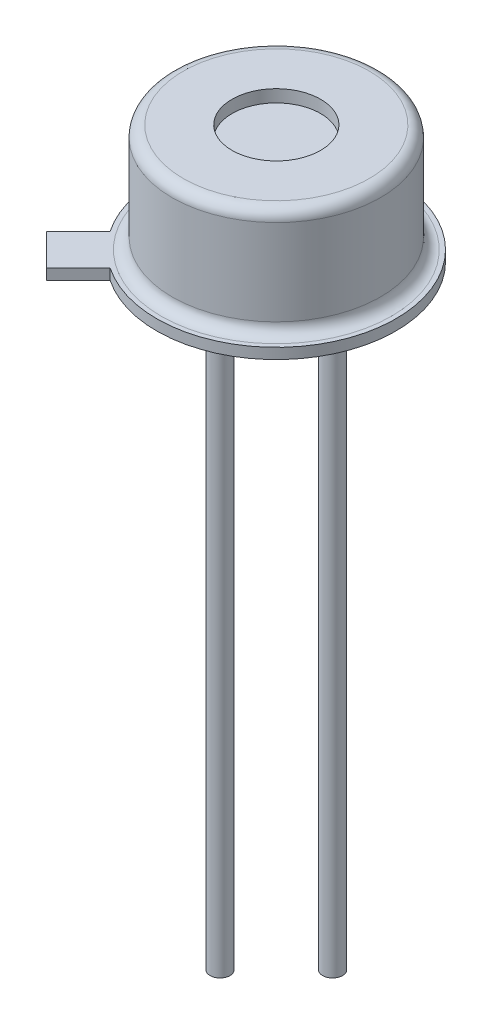
ISO-10303-21;
HEADER;
FILE_DESCRIPTION(('STEP AP214'),'2;1');
FILE_NAME('part.step','',(''),(''),'','','');
FILE_SCHEMA(('AUTOMOTIVE_DESIGN { 1 0 10303 214 1 1 1 1 }'));
ENDSEC;
DATA;
#1=APPLICATION_CONTEXT('core data for automotive mechanical design processes');
#2=APPLICATION_PROTOCOL_DEFINITION('international standard','automotive_design',2000,#1);
#3=PRODUCT_CONTEXT('',#1,'mechanical');
#4=PRODUCT('Part','Part','',(#3));
#5=PRODUCT_RELATED_PRODUCT_CATEGORY('part','',(#4));
#6=PRODUCT_DEFINITION_FORMATION('','',#4);
#7=PRODUCT_DEFINITION_CONTEXT('part definition',#1,'design');
#8=PRODUCT_DEFINITION('design','',#6,#7);
#9=PRODUCT_DEFINITION_SHAPE('','',#8);
#10=(LENGTH_UNIT() NAMED_UNIT(*) SI_UNIT(.MILLI.,.METRE.));
#11=(NAMED_UNIT(*) PLANE_ANGLE_UNIT() SI_UNIT($,.RADIAN.));
#12=(NAMED_UNIT(*) SI_UNIT($,.STERADIAN.) SOLID_ANGLE_UNIT());
#13=UNCERTAINTY_MEASURE_WITH_UNIT(LENGTH_MEASURE(1.E-05),#10,'distance_accuracy_value','');
#14=(GEOMETRIC_REPRESENTATION_CONTEXT(3) GLOBAL_UNCERTAINTY_ASSIGNED_CONTEXT((#13)) GLOBAL_UNIT_ASSIGNED_CONTEXT((#10,
#11,#12)) REPRESENTATION_CONTEXT('',''));
#15=CARTESIAN_POINT('',(0.,0.,0.));
#16=DIRECTION('',(0.,0.,1.));
#17=DIRECTION('',(1.,0.,0.));
#18=AXIS2_PLACEMENT_3D('',#15,#16,#17);
#19=CARTESIAN_POINT('',(0.,0.,0.));
#20=DIRECTION('',(0.,1.,0.));
#21=DIRECTION('',(0.,0.,1.));
#22=AXIS2_PLACEMENT_3D('',#19,#20,#21);
#23=PLANE('',#22);
#24=CARTESIAN_POINT('',(0.,0.,-1.27));
#25=DIRECTION('',(0.,1.,0.));
#26=DIRECTION('',(0.,0.,1.));
#27=AXIS2_PLACEMENT_3D('',#24,#25,#26);
#28=CIRCLE('',#27,0.6);
#29=CARTESIAN_POINT('',(0.,0.,-0.67));
#30=VERTEX_POINT('',#29);
#31=EDGE_CURVE('E47',#30,#30,#28,.F.);
#32=ORIENTED_EDGE('',*,*,#31,.F.);
#33=EDGE_LOOP('',(#32));
#34=FACE_BOUND('',#33,.T.);
#35=CARTESIAN_POINT('',(0.,0.,0.));
#36=DIRECTION('',(0.,1.,0.));
#37=DIRECTION('',(0.,0.,1.));
#38=AXIS2_PLACEMENT_3D('',#35,#36,#37);
#39=CIRCLE('',#38,2.7);
#40=CARTESIAN_POINT('',(-1.51588121959302,0.,2.23430170927858));
#41=VERTEX_POINT('',#40);
#42=CARTESIAN_POINT('',(-2.23430170927856,0.,1.51588121959305));
#43=VERTEX_POINT('',#42);
#44=EDGE_CURVE('E106',#41,#43,#39,.T.);
#45=ORIENTED_EDGE('',*,*,#44,.F.);
#46=DIRECTION('',(0.707106781186544,0.,-0.707106781186551));
#47=VECTOR('',#46,1.);
#48=CARTESIAN_POINT('',(-2.23430170927855,0.,2.95272219896411));
#49=LINE('',#48,#47);
#50=CARTESIAN_POINT('',(-2.23430170927855,0.,2.95272219896411));
#51=VERTEX_POINT('',#50);
#52=EDGE_CURVE('E78',#51,#41,#49,.T.);
#53=ORIENTED_EDGE('',*,*,#52,.F.);
#54=DIRECTION('',(0.707106781186551,0.,0.707106781186544));
#55=VECTOR('',#54,1.);
#56=CARTESIAN_POINT('',(-2.95272219896409,0.,2.23430170927858));
#57=LINE('',#56,#55);
#58=CARTESIAN_POINT('',(-2.95272219896409,0.,2.23430170927858));
#59=VERTEX_POINT('',#58);
#60=EDGE_CURVE('E72',#59,#51,#57,.T.);
#61=ORIENTED_EDGE('',*,*,#60,.F.);
#62=DIRECTION('',(-0.707106781186544,0.,0.707106781186551));
#63=VECTOR('',#62,1.);
#64=CARTESIAN_POINT('',(-2.23430170927856,0.,1.51588121959305));
#65=LINE('',#64,#63);
#66=EDGE_CURVE('E96',#43,#59,#65,.T.);
#67=ORIENTED_EDGE('',*,*,#66,.F.);
#68=EDGE_LOOP('',(#45,#53,#61,#67));
#69=FACE_BOUND('',#68,.T.);
#70=CARTESIAN_POINT('',(1.27,0.,0.));
#71=DIRECTION('',(0.,1.,0.));
#72=DIRECTION('',(0.,0.,1.));
#73=AXIS2_PLACEMENT_3D('',#70,#71,#72);
#74=CIRCLE('',#73,0.225);
#75=CARTESIAN_POINT('',(1.27,0.,0.225));
#76=VERTEX_POINT('',#75);
#77=EDGE_CURVE('E122',#76,#76,#74,.F.);
#78=ORIENTED_EDGE('',*,*,#77,.F.);
#79=EDGE_LOOP('',(#78));
#80=FACE_BOUND('',#79,.T.);
#81=CARTESIAN_POINT('',(0.,0.,1.27));
#82=DIRECTION('',(0.,1.,0.));
#83=DIRECTION('',(0.,0.,1.));
#84=AXIS2_PLACEMENT_3D('',#81,#82,#83);
#85=CIRCLE('',#84,0.6);
#86=CARTESIAN_POINT('',(0.,0.,1.87));
#87=VERTEX_POINT('',#86);
#88=EDGE_CURVE('E11',#87,#87,#85,.F.);
#89=ORIENTED_EDGE('',*,*,#88,.F.);
#90=EDGE_LOOP('',(#89));
#91=FACE_BOUND('',#90,.T.);
#92=ADVANCED_FACE('F37',(#34,#69,#80,#91),#23,.F.);
#93=ORIENTED_EDGE('',*,*,#88,.T.);
#94=EDGE_LOOP('',(#93));
#95=FACE_BOUND('',#94,.T.);
#96=CARTESIAN_POINT('',(0.,0.,1.27));
#97=DIRECTION('',(0.,1.,0.));
#98=DIRECTION('',(0.,0.,1.));
#99=AXIS2_PLACEMENT_3D('',#96,#97,#98);
#100=CIRCLE('',#99,0.225);
#101=CARTESIAN_POINT('',(0.,0.,1.495));
#102=VERTEX_POINT('',#101);
#103=EDGE_CURVE('E116',#102,#102,#100,.F.);
#104=ORIENTED_EDGE('',*,*,#103,.F.);
#105=EDGE_LOOP('',(#104));
#106=FACE_BOUND('',#105,.T.);
#107=ADVANCED_FACE('F147',(#95,#106),#23,.F.);
#108=ORIENTED_EDGE('',*,*,#31,.T.);
#109=EDGE_LOOP('',(#108));
#110=FACE_BOUND('',#109,.T.);
#111=CARTESIAN_POINT('',(0.,0.,-1.27));
#112=DIRECTION('',(0.,1.,0.));
#113=DIRECTION('',(0.,0.,1.));
#114=AXIS2_PLACEMENT_3D('',#111,#112,#113);
#115=CIRCLE('',#114,0.225);
#116=CARTESIAN_POINT('',(0.,0.,-1.045));
#117=VERTEX_POINT('',#116);
#118=EDGE_CURVE('E119',#117,#117,#115,.F.);
#119=ORIENTED_EDGE('',*,*,#118,.F.);
#120=EDGE_LOOP('',(#119));
#121=FACE_BOUND('',#120,.T.);
#122=ADVANCED_FACE('F142',(#110,#121),#23,.F.);
#123=CARTESIAN_POINT('',(0.,0.24,0.));
#124=DIRECTION('',(0.,1.,0.));
#125=DIRECTION('',(0.,0.,1.));
#126=AXIS2_PLACEMENT_3D('',#123,#124,#125);
#127=PLANE('',#126);
#128=CARTESIAN_POINT('',(0.,0.24,0.));
#129=DIRECTION('',(0.,1.,0.));
#130=DIRECTION('',(0.,0.,1.));
#131=AXIS2_PLACEMENT_3D('',#128,#129,#130);
#132=CIRCLE('',#131,2.6);
#133=CARTESIAN_POINT('',(0.,0.24,2.6));
#134=VERTEX_POINT('',#133);
#135=EDGE_CURVE('E134',#134,#134,#132,.F.);
#136=ORIENTED_EDGE('',*,*,#135,.T.);
#137=EDGE_LOOP('',(#136));
#138=FACE_BOUND('',#137,.T.);
#139=CARTESIAN_POINT('',(0.,0.24,0.));
#140=DIRECTION('',(0.,1.,0.));
#141=DIRECTION('',(0.,0.,1.));
#142=AXIS2_PLACEMENT_3D('',#139,#140,#141);
#143=CIRCLE('',#142,2.7);
#144=CARTESIAN_POINT('',(-1.51588121959302,0.24,2.23430170927858));
#145=VERTEX_POINT('',#144);
#146=CARTESIAN_POINT('',(-2.23430170927856,0.24,1.51588121959305));
#147=VERTEX_POINT('',#146);
#148=EDGE_CURVE('E91',#145,#147,#143,.T.);
#149=ORIENTED_EDGE('',*,*,#148,.T.);
#150=DIRECTION('',(-0.707106781186544,0.,0.707106781186551));
#151=VECTOR('',#150,1.);
#152=CARTESIAN_POINT('',(-2.23430170927856,0.24,1.51588121959305));
#153=LINE('',#152,#151);
#154=CARTESIAN_POINT('',(-2.95272219896409,0.24,2.23430170927858));
#155=VERTEX_POINT('',#154);
#156=EDGE_CURVE('E86',#147,#155,#153,.T.);
#157=ORIENTED_EDGE('',*,*,#156,.T.);
#158=DIRECTION('',(0.707106781186551,0.,0.707106781186544));
#159=VECTOR('',#158,1.);
#160=CARTESIAN_POINT('',(-2.95272219896409,0.24,2.23430170927858));
#161=LINE('',#160,#159);
#162=CARTESIAN_POINT('',(-2.23430170927855,0.24,2.95272219896411));
#163=VERTEX_POINT('',#162);
#164=EDGE_CURVE('E89',#155,#163,#161,.T.);
#165=ORIENTED_EDGE('',*,*,#164,.T.);
#166=DIRECTION('',(0.707106781186544,0.,-0.707106781186551));
#167=VECTOR('',#166,1.);
#168=CARTESIAN_POINT('',(-2.23430170927855,0.24,2.95272219896411));
#169=LINE('',#168,#167);
#170=EDGE_CURVE('E55',#163,#145,#169,.T.);
#171=ORIENTED_EDGE('',*,*,#170,.T.);
#172=EDGE_LOOP('',(#149,#157,#165,#171));
#173=FACE_BOUND('',#172,.T.);
#174=ADVANCED_FACE('F87',(#138,#173),#127,.T.);
#175=CARTESIAN_POINT('',(0.,0.24,0.));
#176=DIRECTION('',(0.,-1.,0.));
#177=DIRECTION('',(0.,0.,-1.));
#178=AXIS2_PLACEMENT_3D('',#175,#176,#177);
#179=CYLINDRICAL_SURFACE('',#178,2.7);
#180=ORIENTED_EDGE('',*,*,#44,.T.);
#181=DIRECTION('',(0.,-1.,0.));
#182=VECTOR('',#181,1.);
#183=CARTESIAN_POINT('',(-2.23430170927856,0.24,1.51588121959305));
#184=LINE('',#183,#182);
#185=EDGE_CURVE('E97',#147,#43,#184,.T.);
#186=ORIENTED_EDGE('',*,*,#185,.F.);
#187=ORIENTED_EDGE('',*,*,#148,.F.);
#188=DIRECTION('',(0.,-1.,0.));
#189=VECTOR('',#188,1.);
#190=CARTESIAN_POINT('',(-1.51588121959302,0.24,2.23430170927858));
#191=LINE('',#190,#189);
#192=EDGE_CURVE('E102',#145,#41,#191,.T.);
#193=ORIENTED_EDGE('',*,*,#192,.T.);
#194=EDGE_LOOP('',(#180,#186,#187,#193));
#195=FACE_BOUND('',#194,.T.);
#196=ADVANCED_FACE('F191',(#195),#179,.T.);
#197=CARTESIAN_POINT('',(-2.23430170927856,0.24,1.51588121959305));
#198=DIRECTION('',(0.707106781186551,0.,0.707106781186544));
#199=DIRECTION('',(0.707106781186544,0.,-0.707106781186551));
#200=AXIS2_PLACEMENT_3D('',#197,#198,#199);
#201=PLANE('',#200);
#202=ORIENTED_EDGE('',*,*,#66,.T.);
#203=DIRECTION('',(0.,-1.,0.));
#204=VECTOR('',#203,1.);
#205=CARTESIAN_POINT('',(-2.95272219896409,0.24,2.23430170927858));
#206=LINE('',#205,#204);
#207=EDGE_CURVE('E94',#155,#59,#206,.T.);
#208=ORIENTED_EDGE('',*,*,#207,.F.);
#209=ORIENTED_EDGE('',*,*,#156,.F.);
#210=ORIENTED_EDGE('',*,*,#185,.T.);
#211=EDGE_LOOP('',(#202,#208,#209,#210));
#212=FACE_BOUND('',#211,.T.);
#213=ADVANCED_FACE('F95',(#212),#201,.F.);
#214=CARTESIAN_POINT('',(-2.95272219896409,0.24,2.23430170927858));
#215=DIRECTION('',(0.707106781186544,0.,-0.707106781186551));
#216=DIRECTION('',(-0.707106781186551,0.,-0.707106781186544));
#217=AXIS2_PLACEMENT_3D('',#214,#215,#216);
#218=PLANE('',#217);
#219=ORIENTED_EDGE('',*,*,#60,.T.);
#220=DIRECTION('',(0.,-1.,0.));
#221=VECTOR('',#220,1.);
#222=CARTESIAN_POINT('',(-2.23430170927855,0.24,2.95272219896411));
#223=LINE('',#222,#221);
#224=EDGE_CURVE('E98',#163,#51,#223,.T.);
#225=ORIENTED_EDGE('',*,*,#224,.F.);
#226=ORIENTED_EDGE('',*,*,#164,.F.);
#227=ORIENTED_EDGE('',*,*,#207,.T.);
#228=EDGE_LOOP('',(#219,#225,#226,#227));
#229=FACE_BOUND('',#228,.T.);
#230=ADVANCED_FACE('F100',(#229),#218,.F.);
#231=CARTESIAN_POINT('',(-2.23430170927855,0.24,2.95272219896411));
#232=DIRECTION('',(-0.707106781186551,0.,-0.707106781186544));
#233=DIRECTION('',(-0.707106781186544,0.,0.707106781186551));
#234=AXIS2_PLACEMENT_3D('',#231,#232,#233);
#235=PLANE('',#234);
#236=ORIENTED_EDGE('',*,*,#52,.T.);
#237=ORIENTED_EDGE('',*,*,#192,.F.);
#238=ORIENTED_EDGE('',*,*,#170,.F.);
#239=ORIENTED_EDGE('',*,*,#224,.T.);
#240=EDGE_LOOP('',(#236,#237,#238,#239));
#241=FACE_BOUND('',#240,.T.);
#242=ADVANCED_FACE('F188',(#241),#235,.F.);
#243=CARTESIAN_POINT('',(0.,2.68,0.));
#244=DIRECTION('',(0.,-1.,0.));
#245=DIRECTION('',(0.,0.,-1.));
#246=AXIS2_PLACEMENT_3D('',#243,#244,#245);
#247=CYLINDRICAL_SURFACE('',#246,2.35);
#248=CARTESIAN_POINT('',(0.,2.43,0.));
#249=DIRECTION('',(0.,1.,0.));
#250=DIRECTION('',(0.,0.,1.));
#251=AXIS2_PLACEMENT_3D('',#248,#249,#250);
#252=CIRCLE('',#251,2.35);
#253=CARTESIAN_POINT('',(0.,2.43,2.35));
#254=VERTEX_POINT('',#253);
#255=EDGE_CURVE('E131',#254,#254,#252,.F.);
#256=ORIENTED_EDGE('',*,*,#255,.T.);
#257=EDGE_LOOP('',(#256));
#258=FACE_BOUND('',#257,.T.);
#259=CARTESIAN_POINT('',(0.,0.49,0.));
#260=DIRECTION('',(0.,1.,0.));
#261=DIRECTION('',(0.,0.,1.));
#262=AXIS2_PLACEMENT_3D('',#259,#260,#261);
#263=CIRCLE('',#262,2.35);
#264=CARTESIAN_POINT('',(0.,0.49,2.35));
#265=VERTEX_POINT('',#264);
#266=EDGE_CURVE('E128',#265,#265,#263,.T.);
#267=ORIENTED_EDGE('',*,*,#266,.T.);
#268=EDGE_LOOP('',(#267));
#269=FACE_BOUND('',#268,.T.);
#270=ADVANCED_FACE('F184',(#258,#269),#247,.T.);
#271=CARTESIAN_POINT('',(0.,2.68,0.));
#272=DIRECTION('',(0.,1.,0.));
#273=DIRECTION('',(0.,0.,1.));
#274=AXIS2_PLACEMENT_3D('',#271,#272,#273);
#275=PLANE('',#274);
#276=CARTESIAN_POINT('',(0.,2.68,0.));
#277=DIRECTION('',(0.,1.,0.));
#278=DIRECTION('',(0.,0.,1.));
#279=AXIS2_PLACEMENT_3D('',#276,#277,#278);
#280=CIRCLE('',#279,2.1);
#281=CARTESIAN_POINT('',(0.,2.68,2.1));
#282=VERTEX_POINT('',#281);
#283=EDGE_CURVE('E125',#282,#282,#280,.T.);
#284=ORIENTED_EDGE('',*,*,#283,.T.);
#285=EDGE_LOOP('',(#284));
#286=FACE_BOUND('',#285,.T.);
#287=CARTESIAN_POINT('',(0.,2.68,0.));
#288=DIRECTION('',(0.,1.,0.));
#289=DIRECTION('',(0.,0.,1.));
#290=AXIS2_PLACEMENT_3D('',#287,#288,#289);
#291=CIRCLE('',#290,1.);
#292=CARTESIAN_POINT('',(0.,2.68,1.));
#293=VERTEX_POINT('',#292);
#294=EDGE_CURVE('E221',#293,#293,#291,.T.);
#295=ORIENTED_EDGE('',*,*,#294,.F.);
#296=EDGE_LOOP('',(#295));
#297=FACE_BOUND('',#296,.T.);
#298=ADVANCED_FACE('F180',(#286,#297),#275,.T.);
#299=CARTESIAN_POINT('',(0.,2.4006,0.));
#300=DIRECTION('',(0.,1.,0.));
#301=DIRECTION('',(0.,0.,1.));
#302=AXIS2_PLACEMENT_3D('',#299,#300,#301);
#303=CYLINDRICAL_SURFACE('',#302,1.);
#304=CARTESIAN_POINT('',(0.,2.4006,0.));
#305=DIRECTION('',(0.,1.,0.));
#306=DIRECTION('',(0.,0.,1.));
#307=AXIS2_PLACEMENT_3D('',#304,#305,#306);
#308=CIRCLE('',#307,1.);
#309=CARTESIAN_POINT('',(0.,2.4006,1.));
#310=VERTEX_POINT('',#309);
#311=EDGE_CURVE('E109',#310,#310,#308,.T.);
#312=ORIENTED_EDGE('',*,*,#311,.F.);
#313=EDGE_LOOP('',(#312));
#314=FACE_BOUND('',#313,.T.);
#315=ORIENTED_EDGE('',*,*,#294,.T.);
#316=EDGE_LOOP('',(#315));
#317=FACE_BOUND('',#316,.T.);
#318=ADVANCED_FACE('F172',(#314,#317),#303,.F.);
#319=CARTESIAN_POINT('',(0.,2.4006,0.));
#320=DIRECTION('',(0.,1.,0.));
#321=DIRECTION('',(0.,0.,1.));
#322=AXIS2_PLACEMENT_3D('',#319,#320,#321);
#323=PLANE('',#322);
#324=ORIENTED_EDGE('',*,*,#311,.T.);
#325=EDGE_LOOP('',(#324));
#326=FACE_BOUND('',#325,.T.);
#327=ADVANCED_FACE('F162',(#326),#323,.T.);
#328=CARTESIAN_POINT('',(0.,-13.2,1.27));
#329=DIRECTION('',(0.,1.,0.));
#330=DIRECTION('',(0.,0.,1.));
#331=AXIS2_PLACEMENT_3D('',#328,#329,#330);
#332=CYLINDRICAL_SURFACE('',#331,0.225);
#333=CARTESIAN_POINT('',(0.,-13.2,1.27));
#334=DIRECTION('',(0.,-1.,0.));
#335=DIRECTION('',(0.,0.,-1.));
#336=AXIS2_PLACEMENT_3D('',#333,#334,#335);
#337=CIRCLE('',#336,0.225);
#338=CARTESIAN_POINT('',(0.,-13.2,1.045));
#339=VERTEX_POINT('',#338);
#340=EDGE_CURVE('E223',#339,#339,#337,.T.);
#341=ORIENTED_EDGE('',*,*,#340,.F.);
#342=EDGE_LOOP('',(#341));
#343=FACE_BOUND('',#342,.T.);
#344=ORIENTED_EDGE('',*,*,#103,.T.);
#345=EDGE_LOOP('',(#344));
#346=FACE_BOUND('',#345,.T.);
#347=ADVANCED_FACE('F159',(#343,#346),#332,.T.);
#348=CARTESIAN_POINT('',(0.,-13.2,1.27));
#349=DIRECTION('',(0.,-1.,0.));
#350=DIRECTION('',(0.,0.,-1.));
#351=AXIS2_PLACEMENT_3D('',#348,#349,#350);
#352=PLANE('',#351);
#353=ORIENTED_EDGE('',*,*,#340,.T.);
#354=EDGE_LOOP('',(#353));
#355=FACE_BOUND('',#354,.T.);
#356=ADVANCED_FACE('F161',(#355),#352,.T.);
#357=CARTESIAN_POINT('',(0.,-13.2,-1.27));
#358=DIRECTION('',(0.,1.,0.));
#359=DIRECTION('',(0.,0.,1.));
#360=AXIS2_PLACEMENT_3D('',#357,#358,#359);
#361=CYLINDRICAL_SURFACE('',#360,0.225);
#362=CARTESIAN_POINT('',(0.,-13.2,-1.27));
#363=DIRECTION('',(0.,-1.,0.));
#364=DIRECTION('',(0.,0.,-1.));
#365=AXIS2_PLACEMENT_3D('',#362,#363,#364);
#366=CIRCLE('',#365,0.225);
#367=CARTESIAN_POINT('',(0.,-13.2,-1.495));
#368=VERTEX_POINT('',#367);
#369=EDGE_CURVE('E228',#368,#368,#366,.T.);
#370=ORIENTED_EDGE('',*,*,#369,.F.);
#371=EDGE_LOOP('',(#370));
#372=FACE_BOUND('',#371,.T.);
#373=ORIENTED_EDGE('',*,*,#118,.T.);
#374=EDGE_LOOP('',(#373));
#375=FACE_BOUND('',#374,.T.);
#376=ADVANCED_FACE('F169',(#372,#375),#361,.T.);
#377=CARTESIAN_POINT('',(0.,-13.2,-1.27));
#378=DIRECTION('',(0.,-1.,0.));
#379=DIRECTION('',(0.,0.,-1.));
#380=AXIS2_PLACEMENT_3D('',#377,#378,#379);
#381=PLANE('',#380);
#382=ORIENTED_EDGE('',*,*,#369,.T.);
#383=EDGE_LOOP('',(#382));
#384=FACE_BOUND('',#383,.T.);
#385=ADVANCED_FACE('F239',(#384),#381,.T.);
#386=CARTESIAN_POINT('',(1.27,-13.2,0.));
#387=DIRECTION('',(0.,1.,0.));
#388=DIRECTION('',(0.,0.,1.));
#389=AXIS2_PLACEMENT_3D('',#386,#387,#388);
#390=CYLINDRICAL_SURFACE('',#389,0.225);
#391=CARTESIAN_POINT('',(1.27,-13.2,0.));
#392=DIRECTION('',(0.,-1.,0.));
#393=DIRECTION('',(0.,0.,-1.));
#394=AXIS2_PLACEMENT_3D('',#391,#392,#393);
#395=CIRCLE('',#394,0.225);
#396=CARTESIAN_POINT('',(1.27,-13.2,-0.225));
#397=VERTEX_POINT('',#396);
#398=EDGE_CURVE('E233',#397,#397,#395,.T.);
#399=ORIENTED_EDGE('',*,*,#398,.F.);
#400=EDGE_LOOP('',(#399));
#401=FACE_BOUND('',#400,.T.);
#402=ORIENTED_EDGE('',*,*,#77,.T.);
#403=EDGE_LOOP('',(#402));
#404=FACE_BOUND('',#403,.T.);
#405=ADVANCED_FACE('F212',(#401,#404),#390,.T.);
#406=CARTESIAN_POINT('',(1.27,-13.2,0.));
#407=DIRECTION('',(0.,-1.,0.));
#408=DIRECTION('',(0.,0.,-1.));
#409=AXIS2_PLACEMENT_3D('',#406,#407,#408);
#410=PLANE('',#409);
#411=ORIENTED_EDGE('',*,*,#398,.T.);
#412=EDGE_LOOP('',(#411));
#413=FACE_BOUND('',#412,.T.);
#414=ADVANCED_FACE('F205',(#413),#410,.T.);
#415=CARTESIAN_POINT('',(0.,2.43,0.));
#416=DIRECTION('',(0.,1.,0.));
#417=DIRECTION('',(0.,0.,1.));
#418=AXIS2_PLACEMENT_3D('',#415,#416,#417);
#419=TOROIDAL_SURFACE('',#418,2.1,0.25);
#420=ORIENTED_EDGE('',*,*,#255,.F.);
#421=EDGE_LOOP('',(#420));
#422=FACE_BOUND('',#421,.T.);
#423=ORIENTED_EDGE('',*,*,#283,.F.);
#424=EDGE_LOOP('',(#423));
#425=FACE_BOUND('',#424,.T.);
#426=ADVANCED_FACE('F203',(#422,#425),#419,.T.);
#427=CARTESIAN_POINT('',(0.,0.49,0.));
#428=DIRECTION('',(0.,1.,0.));
#429=DIRECTION('',(0.,0.,1.));
#430=AXIS2_PLACEMENT_3D('',#427,#428,#429);
#431=TOROIDAL_SURFACE('',#430,2.6,0.25);
#432=ORIENTED_EDGE('',*,*,#135,.F.);
#433=EDGE_LOOP('',(#432));
#434=FACE_BOUND('',#433,.T.);
#435=ORIENTED_EDGE('',*,*,#266,.F.);
#436=EDGE_LOOP('',(#435));
#437=FACE_BOUND('',#436,.T.);
#438=ADVANCED_FACE('F39',(#434,#437),#431,.F.);
#439=CLOSED_SHELL('',(#92,#107,#122,#174,#196,#213,#230,#242,#270,#298,#318,#327,#347,#356,#376,
#385,#405,#414,#426,#438));
#440=MANIFOLD_SOLID_BREP('B2',#439);
#441=ADVANCED_BREP_SHAPE_REPRESENTATION('',(#18,#440),#14);
#442=SHAPE_DEFINITION_REPRESENTATION(#9,#441);
ENDSEC;
END-ISO-10303-21;
